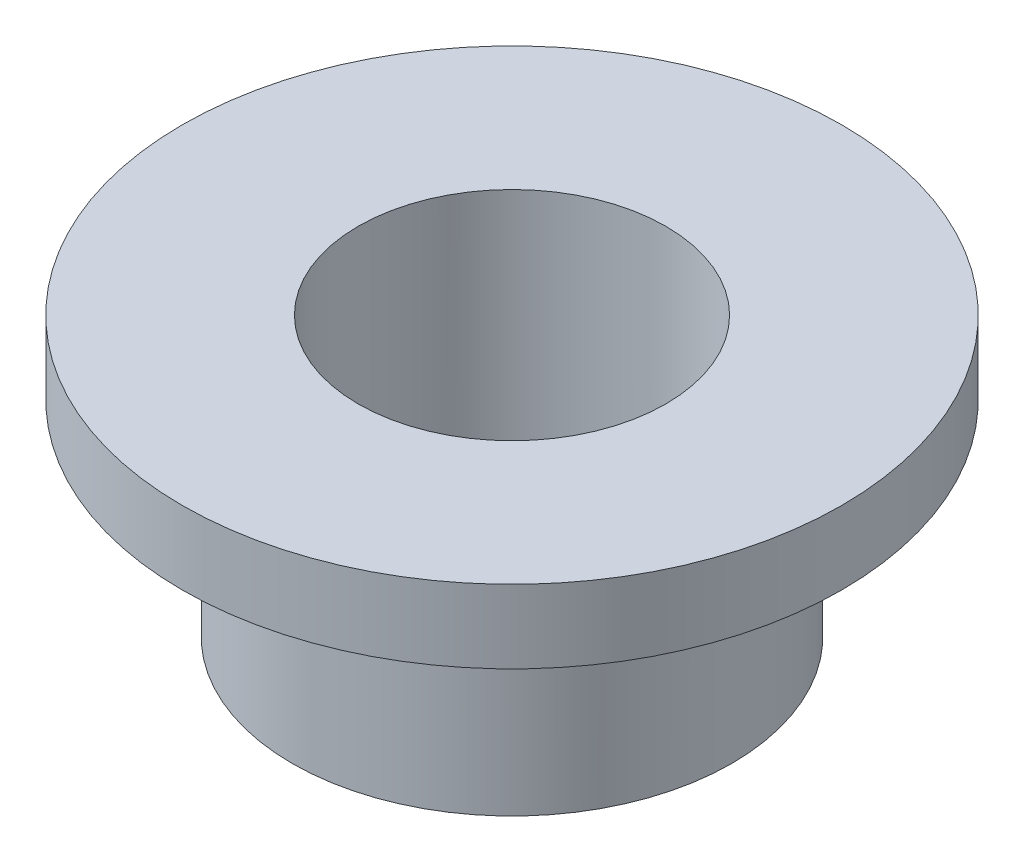
ISO-10303-21;
HEADER;
FILE_DESCRIPTION(('STEP AP214'),'2;1');
FILE_NAME('part.step','',(''),(''),'','','');
FILE_SCHEMA(('AUTOMOTIVE_DESIGN { 1 0 10303 214 1 1 1 1 }'));
ENDSEC;
DATA;
#1=APPLICATION_CONTEXT('core data for automotive mechanical design processes');
#2=APPLICATION_PROTOCOL_DEFINITION('international standard','automotive_design',2000,#1);
#3=PRODUCT_CONTEXT('',#1,'mechanical');
#4=PRODUCT('Part','Part','',(#3));
#5=PRODUCT_RELATED_PRODUCT_CATEGORY('part','',(#4));
#6=PRODUCT_DEFINITION_FORMATION('','',#4);
#7=PRODUCT_DEFINITION_CONTEXT('part definition',#1,'design');
#8=PRODUCT_DEFINITION('design','',#6,#7);
#9=PRODUCT_DEFINITION_SHAPE('','',#8);
#10=(LENGTH_UNIT() NAMED_UNIT(*) SI_UNIT(.MILLI.,.METRE.));
#11=(NAMED_UNIT(*) PLANE_ANGLE_UNIT() SI_UNIT($,.RADIAN.));
#12=(NAMED_UNIT(*) SI_UNIT($,.STERADIAN.) SOLID_ANGLE_UNIT());
#13=UNCERTAINTY_MEASURE_WITH_UNIT(LENGTH_MEASURE(1.E-05),#10,'distance_accuracy_value','');
#14=(GEOMETRIC_REPRESENTATION_CONTEXT(3) GLOBAL_UNCERTAINTY_ASSIGNED_CONTEXT((#13)) GLOBAL_UNIT_ASSIGNED_CONTEXT((#10,
#11,#12)) REPRESENTATION_CONTEXT('',''));
#15=CARTESIAN_POINT('',(0.,0.,0.));
#16=DIRECTION('',(0.,0.,1.));
#17=DIRECTION('',(1.,0.,0.));
#18=AXIS2_PLACEMENT_3D('',#15,#16,#17);
#19=CARTESIAN_POINT('',(0.,0.,0.));
#20=DIRECTION('',(0.,1.,0.));
#21=DIRECTION('',(0.,0.,1.));
#22=AXIS2_PLACEMENT_3D('',#19,#20,#21);
#23=PLANE('',#22);
#24=CARTESIAN_POINT('',(0.,0.,0.));
#25=DIRECTION('',(0.,1.,0.));
#26=DIRECTION('',(0.,0.,1.));
#27=AXIS2_PLACEMENT_3D('',#24,#25,#26);
#28=CIRCLE('',#27,4.5);
#29=CARTESIAN_POINT('',(0.,0.,4.5));
#30=VERTEX_POINT('',#29);
#31=EDGE_CURVE('E44',#30,#30,#28,.T.);
#32=ORIENTED_EDGE('',*,*,#31,.F.);
#33=EDGE_LOOP('',(#32));
#34=FACE_BOUND('',#33,.T.);
#35=CARTESIAN_POINT('',(0.,0.,0.));
#36=DIRECTION('',(0.,1.,0.));
#37=DIRECTION('',(0.,0.,1.));
#38=AXIS2_PLACEMENT_3D('',#35,#36,#37);
#39=CIRCLE('',#38,3.);
#40=CARTESIAN_POINT('',(0.,0.,3.));
#41=VERTEX_POINT('',#40);
#42=EDGE_CURVE('E10',#41,#41,#39,.F.);
#43=ORIENTED_EDGE('',*,*,#42,.F.);
#44=EDGE_LOOP('',(#43));
#45=FACE_BOUND('',#44,.T.);
#46=ADVANCED_FACE('F33',(#34,#45),#23,.F.);
#47=CARTESIAN_POINT('',(0.,1.,0.));
#48=DIRECTION('',(0.,1.,0.));
#49=DIRECTION('',(0.,0.,1.));
#50=AXIS2_PLACEMENT_3D('',#47,#48,#49);
#51=PLANE('',#50);
#52=CARTESIAN_POINT('',(0.,1.,0.));
#53=DIRECTION('',(0.,1.,0.));
#54=DIRECTION('',(0.,0.,1.));
#55=AXIS2_PLACEMENT_3D('',#52,#53,#54);
#56=CIRCLE('',#55,4.5);
#57=CARTESIAN_POINT('',(0.,1.,4.5));
#58=VERTEX_POINT('',#57);
#59=EDGE_CURVE('E40',#58,#58,#56,.T.);
#60=ORIENTED_EDGE('',*,*,#59,.T.);
#61=EDGE_LOOP('',(#60));
#62=FACE_BOUND('',#61,.T.);
#63=CARTESIAN_POINT('',(0.,1.,0.));
#64=DIRECTION('',(0.,1.,0.));
#65=DIRECTION('',(0.,0.,1.));
#66=AXIS2_PLACEMENT_3D('',#63,#64,#65);
#67=CIRCLE('',#66,2.1);
#68=CARTESIAN_POINT('',(0.,1.,2.1));
#69=VERTEX_POINT('',#68);
#70=EDGE_CURVE('E49',#69,#69,#67,.T.);
#71=ORIENTED_EDGE('',*,*,#70,.F.);
#72=EDGE_LOOP('',(#71));
#73=FACE_BOUND('',#72,.T.);
#74=ADVANCED_FACE('F76',(#62,#73),#51,.T.);
#75=CARTESIAN_POINT('',(0.,1.,0.));
#76=DIRECTION('',(0.,-1.,0.));
#77=DIRECTION('',(0.,0.,-1.));
#78=AXIS2_PLACEMENT_3D('',#75,#76,#77);
#79=CYLINDRICAL_SURFACE('',#78,4.5);
#80=ORIENTED_EDGE('',*,*,#59,.F.);
#81=EDGE_LOOP('',(#80));
#82=FACE_BOUND('',#81,.T.);
#83=ORIENTED_EDGE('',*,*,#31,.T.);
#84=EDGE_LOOP('',(#83));
#85=FACE_BOUND('',#84,.T.);
#86=ADVANCED_FACE('F35',(#82,#85),#79,.T.);
#87=CARTESIAN_POINT('',(0.,1.,0.));
#88=DIRECTION('',(0.,-1.,0.));
#89=DIRECTION('',(0.,0.,-1.));
#90=AXIS2_PLACEMENT_3D('',#87,#88,#89);
#91=CYLINDRICAL_SURFACE('',#90,2.1);
#92=ORIENTED_EDGE('',*,*,#70,.T.);
#93=EDGE_LOOP('',(#92));
#94=FACE_BOUND('',#93,.T.);
#95=CARTESIAN_POINT('',(0.,-2.8,0.));
#96=DIRECTION('',(0.,-1.,0.));
#97=DIRECTION('',(0.,0.,-1.));
#98=AXIS2_PLACEMENT_3D('',#95,#96,#97);
#99=CIRCLE('',#98,2.1);
#100=CARTESIAN_POINT('',(0.,-2.8,-2.1));
#101=VERTEX_POINT('',#100);
#102=EDGE_CURVE('E56',#101,#101,#99,.T.);
#103=ORIENTED_EDGE('',*,*,#102,.T.);
#104=EDGE_LOOP('',(#103));
#105=FACE_BOUND('',#104,.T.);
#106=ADVANCED_FACE('F60',(#94,#105),#91,.F.);
#107=CARTESIAN_POINT('',(0.,-2.8,0.));
#108=DIRECTION('',(0.,-1.,0.));
#109=DIRECTION('',(0.,0.,-1.));
#110=AXIS2_PLACEMENT_3D('',#107,#108,#109);
#111=PLANE('',#110);
#112=CARTESIAN_POINT('',(0.,-2.8,0.));
#113=DIRECTION('',(0.,-1.,0.));
#114=DIRECTION('',(0.,0.,-1.));
#115=AXIS2_PLACEMENT_3D('',#112,#113,#114);
#116=CIRCLE('',#115,3.);
#117=CARTESIAN_POINT('',(0.,-2.8,-3.));
#118=VERTEX_POINT('',#117);
#119=EDGE_CURVE('E53',#118,#118,#116,.T.);
#120=ORIENTED_EDGE('',*,*,#119,.T.);
#121=EDGE_LOOP('',(#120));
#122=FACE_BOUND('',#121,.T.);
#123=ORIENTED_EDGE('',*,*,#102,.F.);
#124=EDGE_LOOP('',(#123));
#125=FACE_BOUND('',#124,.T.);
#126=ADVANCED_FACE('F62',(#122,#125),#111,.T.);
#127=CARTESIAN_POINT('',(0.,-2.8,0.));
#128=DIRECTION('',(0.,1.,0.));
#129=DIRECTION('',(0.,0.,1.));
#130=AXIS2_PLACEMENT_3D('',#127,#128,#129);
#131=CYLINDRICAL_SURFACE('',#130,3.);
#132=ORIENTED_EDGE('',*,*,#119,.F.);
#133=EDGE_LOOP('',(#132));
#134=FACE_BOUND('',#133,.T.);
#135=ORIENTED_EDGE('',*,*,#42,.T.);
#136=EDGE_LOOP('',(#135));
#137=FACE_BOUND('',#136,.T.);
#138=ADVANCED_FACE('F64',(#134,#137),#131,.T.);
#139=CLOSED_SHELL('',(#46,#74,#86,#106,#126,#138));
#140=MANIFOLD_SOLID_BREP('B2',#139);
#141=ADVANCED_BREP_SHAPE_REPRESENTATION('',(#18,#140),#14);
#142=SHAPE_DEFINITION_REPRESENTATION(#9,#141);
ENDSEC;
END-ISO-10303-21;
